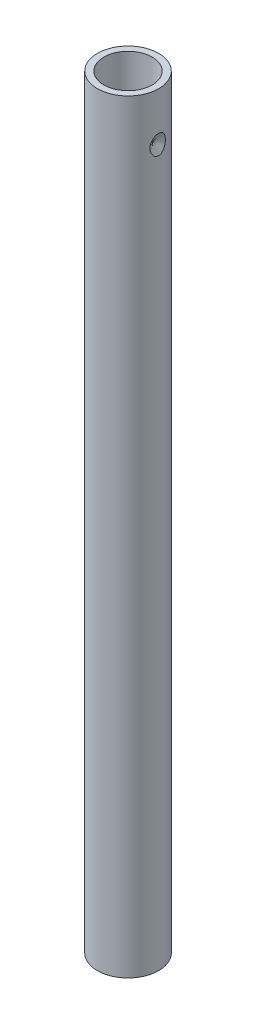
ISO-10303-21;
HEADER;
FILE_DESCRIPTION(('STEP AP214'),'2;1');
FILE_NAME('part.step','',(''),(''),'','','');
FILE_SCHEMA(('AUTOMOTIVE_DESIGN { 1 0 10303 214 1 1 1 1 }'));
ENDSEC;
DATA;
#1=APPLICATION_CONTEXT('core data for automotive mechanical design processes');
#2=APPLICATION_PROTOCOL_DEFINITION('international standard','automotive_design',2000,#1);
#3=PRODUCT_CONTEXT('',#1,'mechanical');
#4=PRODUCT('Part','Part','',(#3));
#5=PRODUCT_RELATED_PRODUCT_CATEGORY('part','',(#4));
#6=PRODUCT_DEFINITION_FORMATION('','',#4);
#7=PRODUCT_DEFINITION_CONTEXT('part definition',#1,'design');
#8=PRODUCT_DEFINITION('design','',#6,#7);
#9=PRODUCT_DEFINITION_SHAPE('','',#8);
#10=(LENGTH_UNIT() NAMED_UNIT(*) SI_UNIT(.MILLI.,.METRE.));
#11=(NAMED_UNIT(*) PLANE_ANGLE_UNIT() SI_UNIT($,.RADIAN.));
#12=(NAMED_UNIT(*) SI_UNIT($,.STERADIAN.) SOLID_ANGLE_UNIT());
#13=UNCERTAINTY_MEASURE_WITH_UNIT(LENGTH_MEASURE(1.E-05),#10,'distance_accuracy_value','');
#14=(GEOMETRIC_REPRESENTATION_CONTEXT(3) GLOBAL_UNCERTAINTY_ASSIGNED_CONTEXT((#13)) GLOBAL_UNIT_ASSIGNED_CONTEXT((#10,
#11,#12)) REPRESENTATION_CONTEXT('',''));
#15=CARTESIAN_POINT('',(0.,0.,0.));
#16=DIRECTION('',(0.,0.,1.));
#17=DIRECTION('',(1.,0.,0.));
#18=AXIS2_PLACEMENT_3D('',#15,#16,#17);
#19=CARTESIAN_POINT('',(0.,237.,0.));
#20=DIRECTION('',(0.,-1.,0.));
#21=DIRECTION('',(0.,0.,-1.));
#22=AXIS2_PLACEMENT_3D('',#19,#20,#21);
#23=CYLINDRICAL_SURFACE('',#22,9.5);
#24=CARTESIAN_POINT('',(9.30331945435661,220.240363881302,-1.92308271537907));
#25=CARTESIAN_POINT('',(9.3205682513565,220.098077717842,-1.83964786494816));
#26=CARTESIAN_POINT('',(9.33898201531258,219.96226362657,-1.74498906637923));
#27=CARTESIAN_POINT('',(9.37605122081402,219.708984713685,-1.53335364857119));
#28=CARTESIAN_POINT('',(9.39470673149405,219.591525272399,-1.41637050759949));
#29=CARTESIAN_POINT('',(9.4248222547172,219.411040334109,-1.19640808146251));
#30=CARTESIAN_POINT('',(9.43684581135679,219.341943065757,-1.09849638038467));
#31=CARTESIAN_POINT('',(9.45853707007024,219.220367872439,-0.892610310459543));
#32=CARTESIAN_POINT('',(9.46820755645551,219.167870283355,-0.784648045421287));
#33=CARTESIAN_POINT('',(9.4841662643761,219.082475932955,-0.559794937083566));
#34=CARTESIAN_POINT('',(9.49042453211237,219.049752494483,-0.442834992035052));
#35=CARTESIAN_POINT('',(9.49854000686532,219.007486340731,-0.204641536907017));
#36=CARTESIAN_POINT('',(9.50040072762256,218.997925118159,-0.0834115173820113));
#37=CARTESIAN_POINT('',(9.49951393284147,219.002515250352,0.142445543535518));
#38=CARTESIAN_POINT('',(9.49734350559846,219.013696848995,0.247147282236112));
#39=CARTESIAN_POINT('',(9.48974877754229,219.053297622748,0.453085988887264));
#40=CARTESIAN_POINT('',(9.4843242996034,219.081717736191,0.554322767914701));
#41=CARTESIAN_POINT('',(9.47082129289798,219.153814686052,0.750459033835123));
#42=CARTESIAN_POINT('',(9.46275394930173,219.197427273124,0.845383234557017));
#43=CARTESIAN_POINT('',(9.44467917912963,219.297693337623,1.02784192929846));
#44=CARTESIAN_POINT('',(9.43467057170101,219.354354756482,1.11537187870465));
#45=CARTESIAN_POINT('',(9.4088817797635,219.505293080797,1.31811362262447));
#46=CARTESIAN_POINT('',(9.3924718949125,219.605262119741,1.42901940038598));
#47=CARTESIAN_POINT('',(9.35917459797884,219.821940057669,1.63296589386592));
#48=CARTESIAN_POINT('',(9.34228645910024,219.938675668537,1.72597753733587));
#49=CARTESIAN_POINT('',(9.30946353029029,220.18641888736,1.89510294248025));
#50=CARTESIAN_POINT('',(9.2935464801619,220.317611637433,1.97094717475366));
#51=CARTESIAN_POINT('',(9.26435311198718,220.58932539887,2.10389795054743));
#52=CARTESIAN_POINT('',(9.25107628897011,220.729844619579,2.16100807851897));
#53=CARTESIAN_POINT('',(9.22594654020162,221.046704228526,2.26615158730077));
#54=CARTESIAN_POINT('',(9.21493180000209,221.224519387117,2.30997942188249));
#55=CARTESIAN_POINT('',(9.19964044160906,221.585057470279,2.37014121795866));
#56=CARTESIAN_POINT('',(9.19536729161454,221.767782871789,2.38646102829441));
#57=CARTESIAN_POINT('',(9.19403651493305,222.146589911392,2.39159631780864));
#58=CARTESIAN_POINT('',(9.19750907168689,222.342704575607,2.37839067338919));
#59=CARTESIAN_POINT('',(9.21231794944298,222.73004707859,2.32036118576884));
#60=CARTESIAN_POINT('',(9.22365990447404,222.921271314331,2.27551468918041));
#61=CARTESIAN_POINT('',(9.25272798812209,223.293880719408,2.1542810750237));
#62=CARTESIAN_POINT('',(9.27048098887978,223.475220720325,2.07776099604352));
#63=CARTESIAN_POINT('',(9.30989025188913,223.820755391043,1.89336033066649));
#64=CARTESIAN_POINT('',(9.33154115387053,223.984973123144,1.78552268786872));
#65=CARTESIAN_POINT('',(9.36886589196603,224.243001315043,1.5754584364712));
#66=CARTESIAN_POINT('',(9.3844059064965,224.343240383083,1.48107085666357));
#67=CARTESIAN_POINT('',(9.4143001154384,224.527321161368,1.27730765425575));
#68=CARTESIAN_POINT('',(9.42865618331585,224.611189076309,1.1679564686942));
#69=CARTESIAN_POINT('',(9.4521860182381,224.744494981209,0.956721109213079));
#70=CARTESIAN_POINT('',(9.46182743569667,224.797420988382,0.857098529071551));
#71=CARTESIAN_POINT('',(9.47828310041145,224.8863090338,0.650287593626391));
#72=CARTESIAN_POINT('',(9.4850991519269,224.92228190022,0.54310411799767));
#73=CARTESIAN_POINT('',(9.4951415688533,224.974910400789,0.323188169589253));
#74=CARTESIAN_POINT('',(9.49834658452832,224.991451169721,0.210426766657321));
#75=CARTESIAN_POINT('',(9.50066117146834,225.003420454326,-0.016250813565819));
#76=CARTESIAN_POINT('',(9.49977201052416,224.998855505532,-0.13016662248605));
#77=CARTESIAN_POINT('',(9.49430920263609,224.970500920199,-0.344164209716398));
#78=CARTESIAN_POINT('',(9.49010090673551,224.94861689112,-0.444516932983925));
#79=CARTESIAN_POINT('',(9.47890086546302,224.889440519051,-0.640366365072159));
#80=CARTESIAN_POINT('',(9.47190869686382,224.852145833172,-0.735862333038245));
#81=CARTESIAN_POINT('',(9.45532925880469,224.761696764469,-0.925369644769139));
#82=CARTESIAN_POINT('',(9.44561870751433,224.707771945057,-1.0189991559258));
#83=CARTESIAN_POINT('',(9.42463196922951,224.587482194031,-1.19767389648297));
#84=CARTESIAN_POINT('',(9.41335461016729,224.521107936344,-1.28271261642474));
#85=CARTESIAN_POINT('',(9.38453379375241,224.344514569274,-1.4814993918219));
#86=CARTESIAN_POINT('',(9.36653857813747,224.228359611221,-1.58993051073861));
#87=CARTESIAN_POINT('',(9.33106857755977,223.979828941767,-1.78638208698276));
#88=CARTESIAN_POINT('',(9.3135946841753,223.847427223253,-1.87436914948766));
#89=CARTESIAN_POINT('',(9.28074323950532,223.568968903135,-2.03083229215919));
#90=CARTESIAN_POINT('',(9.26539749799533,223.422750820193,-2.09902617354033));
#91=CARTESIAN_POINT('',(9.23856023120007,223.121982730775,-2.21415691883779));
#92=CARTESIAN_POINT('',(9.22706707168205,222.967436289492,-2.26110279894414));
#93=CARTESIAN_POINT('',(9.20747604162264,222.626626669422,-2.3397313179041));
#94=CARTESIAN_POINT('',(9.20027467926272,222.439401785387,-2.36751738976653));
#95=CARTESIAN_POINT('',(9.19350706778845,222.062565600694,-2.39365820306267));
#96=CARTESIAN_POINT('',(9.19395050298348,221.872951577232,-2.39197561401703));
#97=CARTESIAN_POINT('',(9.20262324866387,221.488097134259,-2.35840079815986));
#98=CARTESIAN_POINT('',(9.21119763968509,221.292981079443,-2.32516956433907));
#99=CARTESIAN_POINT('',(9.23544653246736,220.911760606538,-2.22689797086692));
#100=CARTESIAN_POINT('',(9.25110105847308,220.725632454315,-2.16194706362328));
#101=CARTESIAN_POINT('',(9.27449679740996,220.494573084085,-2.05773576558742));
#102=CARTESIAN_POINT('',(9.28002175486094,220.442732160576,-2.03271302083013));
#103=CARTESIAN_POINT('',(9.29142352676927,220.34045214909,-1.97994447232083));
#104=CARTESIAN_POINT('',(9.29730056568281,220.290013986042,-1.95219692411273));
#105=CARTESIAN_POINT('',(9.30331945435661,220.240363881302,-1.92308271537907));
#106=B_SPLINE_CURVE_WITH_KNOTS('',3,(#24,#25,#26,#27,#28,#29,#30,#31,#32,#33,#34,#35,#36,#37,
#38,#39,#40,#41,#42,#43,#44,#45,#46,#47,#48,#49,#50,#51,#52,#53,#54,#55,#56,#57,#58,#59,#60,#61,
#62,#63,#64,#65,#66,#67,#68,#69,#70,#71,#72,#73,#74,#75,#76,#77,#78,#79,#80,#81,#82,#83,#84,#85,
#86,#87,#88,#89,#90,#91,#92,#93,#94,#95,#96,#97,#98,#99,#100,#101,#102,#103,#104,#105),
.UNSPECIFIED.,.T.,.F.,(4,2,2,2,2,2,2,2,2,2,2,2,2,2,2,2,2,2,2,2,2,2,2,2,2,2,2,2,2,2,2,2,2,2,2,2,
2,2,2,2,4),(0.,0.49732599868141,0.994797506962388,1.35475715395636,1.71428877825985,
2.07692768089329,2.43927672864534,2.75368810941831,3.06811660590518,3.38123120371586,
3.69453686696855,4.14272786991537,4.59164100196807,5.04717674086143,5.50262526985824,
6.05066410321502,6.59898478233917,7.18597963259616,7.77339517105879,8.36330201895839,
8.95240375739144,9.36661027821124,9.78014825729345,10.1184422617407,10.4565198999079,
10.7965860537203,11.1365469107186,11.4435677224101,11.7506352277714,12.074878796439,
12.3993662383006,12.8765227209621,13.3544532309496,13.8388961479173,14.3231333074707,
14.8888368171193,15.4552570036818,16.0468453924263,16.6367749980014,16.8102028624893,
16.9837424908282),.UNSPECIFIED.);
#107=CARTESIAN_POINT('',(9.30331945435661,220.240363881302,-1.92308271537907));
#108=VERTEX_POINT('',#107);
#109=EDGE_CURVE('E12',#108,#108,#106,.T.);
#110=ORIENTED_EDGE('',*,*,#109,.T.);
#111=EDGE_LOOP('',(#110));
#112=FACE_BOUND('',#111,.T.);
#113=CARTESIAN_POINT('',(0.,237.,0.));
#114=DIRECTION('',(0.,1.,0.));
#115=DIRECTION('',(1.,0.,0.));
#116=AXIS2_PLACEMENT_3D('',#113,#114,#115);
#117=CIRCLE('',#116,9.5);
#118=CARTESIAN_POINT('',(9.5,237.,0.));
#119=VERTEX_POINT('',#118);
#120=EDGE_CURVE('E77',#119,#119,#117,.T.);
#121=ORIENTED_EDGE('',*,*,#120,.F.);
#122=EDGE_LOOP('',(#121));
#123=FACE_BOUND('',#122,.T.);
#124=CARTESIAN_POINT('',(0.,0.,0.));
#125=DIRECTION('',(0.,1.,0.));
#126=DIRECTION('',(1.,0.,0.));
#127=AXIS2_PLACEMENT_3D('',#124,#125,#126);
#128=CIRCLE('',#127,9.5);
#129=CARTESIAN_POINT('',(9.5,0.,0.));
#130=VERTEX_POINT('',#129);
#131=EDGE_CURVE('E81',#130,#130,#128,.T.);
#132=ORIENTED_EDGE('',*,*,#131,.T.);
#133=EDGE_LOOP('',(#132));
#134=FACE_BOUND('',#133,.T.);
#135=CARTESIAN_POINT('',(-1.37749113235361,6.84256604088765,-9.3996020299037));
#136=CARTESIAN_POINT('',(-1.43985569767684,6.94520668087784,-9.39046382916753));
#137=CARTESIAN_POINT('',(-1.4932894219653,7.05337982069839,-9.38200901869604));
#138=CARTESIAN_POINT('',(-1.58177515873886,7.27717003093513,-9.36749705033879));
#139=CARTESIAN_POINT('',(-1.61681098481829,7.39279355611727,-9.36144200490249));
#140=CARTESIAN_POINT('',(-1.66844100973732,7.62952605038833,-9.352379612551));
#141=CARTESIAN_POINT('',(-1.68482952199372,7.75068115226809,-9.34940628942647));
#142=CARTESIAN_POINT('',(-1.69830319571157,7.99406121660748,-9.34696803872217));
#143=CARTESIAN_POINT('',(-1.69539152863666,8.11628599999749,-9.34750253472684));
#144=CARTESIAN_POINT('',(-1.66972870552011,8.3642280409708,-9.35212224043738));
#145=CARTESIAN_POINT('',(-1.64607985537263,8.48985077030532,-9.35636808450113));
#146=CARTESIAN_POINT('',(-1.57793207523912,8.73527096172136,-9.36810112195401));
#147=CARTESIAN_POINT('',(-1.53341996080827,8.85506468727446,-9.37559036476636));
#148=CARTESIAN_POINT('',(-1.42489245519886,9.0828901010676,-9.39269108552869));
#149=CARTESIAN_POINT('',(-1.36121493282038,9.19108471363829,-9.40226506172194));
#150=CARTESIAN_POINT('',(-1.21477840409148,9.39356467729315,-9.42230023018946));
#151=CARTESIAN_POINT('',(-1.13205163086649,9.48787308811734,-9.43275990508546));
#152=CARTESIAN_POINT('',(-0.973453104443292,9.63472101547047,-9.45023420646979));
#153=CARTESIAN_POINT('',(-0.901678349842504,9.69168277097968,-9.45742128956647));
#154=CARTESIAN_POINT('',(-0.749636803958259,9.79307168305966,-9.47068369452202));
#155=CARTESIAN_POINT('',(-0.669376134238821,9.83750779167801,-9.47675980929027));
#156=CARTESIAN_POINT('',(-0.501485896658554,9.91169491246701,-9.48712909097785));
#157=CARTESIAN_POINT('',(-0.413809400864985,9.94134271699067,-9.4914096949641));
#158=CARTESIAN_POINT('',(-0.234325356129351,9.98338450743539,-9.49753238715357));
#159=CARTESIAN_POINT('',(-0.142520922030839,9.99579128474075,-9.49937628313823));
#160=CARTESIAN_POINT('',(0.0308205645608719,10.0020122903735,-9.50029834712539));
#161=CARTESIAN_POINT('',(0.112289057590166,9.99785019276744,-9.49967756935338));
#162=CARTESIAN_POINT('',(0.273257048583079,9.97566478404702,-9.49641029634412));
#163=CARTESIAN_POINT('',(0.352756718672331,9.95764268909916,-9.49376397884102));
#164=CARTESIAN_POINT('',(0.50571757329182,9.90940626459443,-9.4868320268608));
#165=CARTESIAN_POINT('',(0.5792784005435,9.87949795688755,-9.48258766982859));
#166=CARTESIAN_POINT('',(0.720947434234786,9.80895523805489,-9.47287098418225));
#167=CARTESIAN_POINT('',(0.789054127139657,9.76831786293886,-9.46739831630021));
#168=CARTESIAN_POINT('',(0.925468342748628,9.6732340685747,-9.45508721433196));
#169=CARTESIAN_POINT('',(0.993075269572028,9.6177969367039,-9.44816618768056));
#170=CARTESIAN_POINT('',(1.11959033981293,9.49781204604392,-9.43401175956139));
#171=CARTESIAN_POINT('',(1.17849373427887,9.4332593507747,-9.42677819032089));
#172=CARTESIAN_POINT('',(1.29591947635516,9.28578904074301,-9.41141068046759));
#173=CARTESIAN_POINT('',(1.35283852262069,9.20158987083923,-9.40332039961641));
#174=CARTESIAN_POINT('',(1.4538670335368,9.02574700840497,-9.38823099783758));
#175=CARTESIAN_POINT('',(1.49796918225618,8.93409910214937,-9.38123250115575));
#176=CARTESIAN_POINT('',(1.57854440019685,8.73174804454626,-9.3680367835614));
#177=CARTESIAN_POINT('',(1.61297690650578,8.62021140429142,-9.36210387529663));
#178=CARTESIAN_POINT('',(1.66437075738392,8.39307017601492,-9.35310363859543));
#179=CARTESIAN_POINT('',(1.68132547771236,8.27746406278032,-9.35003739669271));
#180=CARTESIAN_POINT('',(1.69823462950287,8.03585498279648,-9.34698311565807));
#181=CARTESIAN_POINT('',(1.69675600187014,7.90974592337056,-9.34725453451841));
#182=CARTESIAN_POINT('',(1.6732973675949,7.65948644104403,-9.35148179467974));
#183=CARTESIAN_POINT('',(1.65131272758549,7.53533646724929,-9.35543846866984));
#184=CARTESIAN_POINT('',(1.58663073584787,7.29088411062147,-9.36662665048601));
#185=CARTESIAN_POINT('',(1.54365952059442,7.17065567086621,-9.37390137168461));
#186=CARTESIAN_POINT('',(1.43724818302922,6.93965186999337,-9.39080457590931));
#187=CARTESIAN_POINT('',(1.37379963833491,6.82888042231,-9.40043402704679));
#188=CARTESIAN_POINT('',(1.23075844034427,6.62648650577517,-9.42020068842502));
#189=CARTESIAN_POINT('',(1.15212371007061,6.53418636998365,-9.43028895328503));
#190=CARTESIAN_POINT('',(0.978121952912079,6.36699088866695,-9.44991374051049));
#191=CARTESIAN_POINT('',(0.882796313278833,6.29205353356009,-9.45945155177529));
#192=CARTESIAN_POINT('',(0.70880695196834,6.18405433303919,-9.4737930822712));
#193=CARTESIAN_POINT('',(0.633773644403819,6.14517808139237,-9.47915740360232));
#194=CARTESIAN_POINT('',(0.478216875412631,6.08035083052091,-9.48827460813303));
#195=CARTESIAN_POINT('',(0.397698060893251,6.0543890421966,-9.49202883608645));
#196=CARTESIAN_POINT('',(0.232914232196794,6.01683510852209,-9.49750323265073));
#197=CARTESIAN_POINT('',(0.148634738743084,6.0053045617051,-9.49921468039874));
#198=CARTESIAN_POINT('',(-0.0206431896638417,5.99760634553994,-9.5003542138111));
#199=CARTESIAN_POINT('',(-0.105641524089031,6.00143656235505,-9.49978261365197));
#200=CARTESIAN_POINT('',(-0.267614946469455,6.02337611439722,-9.49655155532033));
#201=CARTESIAN_POINT('',(-0.344734702065267,6.04046536017784,-9.49404130896424));
#202=CARTESIAN_POINT('',(-0.495170973360162,6.08671072641683,-9.48738536183951));
#203=CARTESIAN_POINT('',(-0.568486870832571,6.11586880150578,-9.48323939615987));
#204=CARTESIAN_POINT('',(-0.712866256136216,6.18635690729789,-9.47350463676184));
#205=CARTESIAN_POINT('',(-0.783692556606428,6.22816177423496,-9.46786086564591));
#206=CARTESIAN_POINT('',(-0.91839414750498,6.32162721810866,-9.4557461070722));
#207=CARTESIAN_POINT('',(-0.982267416051691,6.37329064987132,-9.44927488018075));
#208=CARTESIAN_POINT('',(-1.10751843606593,6.48957852245281,-9.43544970847718));
#209=CARTESIAN_POINT('',(-1.16821154670701,6.55493478562768,-9.42806767061829));
#210=CARTESIAN_POINT('',(-1.2800752222758,6.69336488954483,-9.41353236498305));
#211=CARTESIAN_POINT('',(-1.33123927133661,6.76644395792408,-9.4063792564939));
#212=CARTESIAN_POINT('',(-1.37749113235361,6.84256604088765,-9.3996020299037));
#213=B_SPLINE_CURVE_WITH_KNOTS('',3,(#135,#136,#137,#138,#139,#140,#141,#142,#143,#144,#145,
#146,#147,#148,#149,#150,#151,#152,#153,#154,#155,#156,#157,#158,#159,#160,#161,#162,#163,#164,
#165,#166,#167,#168,#169,#170,#171,#172,#173,#174,#175,#176,#177,#178,#179,#180,#181,#182,#183,
#184,#185,#186,#187,#188,#189,#190,#191,#192,#193,#194,#195,#196,#197,#198,#199,#200,#201,#202,
#203,#204,#205,#206,#207,#208,#209,#210,#211,#212),.UNSPECIFIED.,.T.,.F.,(4,2,2,2,2,2,2,2,2,2,2,
2,2,2,2,2,2,2,2,2,2,2,2,2,2,2,2,2,2,2,2,2,2,2,2,2,2,2,4),(0.,0.361017444430087,
0.722351980815375,1.08763466293914,1.4528573221997,1.83471674152935,2.2168178012086,
2.59254232257339,2.96763569472135,3.24228036174028,3.51672824034096,3.79306559109294,
4.06919781324193,4.31270226535074,4.55618535322914,4.79376841053845,5.03141717085944,
5.29352204719309,5.55576941314882,5.86044303228279,6.16529022016759,6.5144461531425,
6.86373437080963,7.24033611522238,7.61702297403163,7.99876231773089,8.38065887240928,
8.74359495063935,9.10564350796716,9.35863500647286,9.61141479242821,9.86526990799474,
10.1190900910628,10.3551123138431,10.5911727770249,10.8375148704518,11.0839284077443,
11.3514899659387,11.6192338133936),.UNSPECIFIED.);
#214=CARTESIAN_POINT('',(-1.37749113235361,6.84256604088765,-9.3996020299037));
#215=VERTEX_POINT('',#214);
#216=EDGE_CURVE('E59',#215,#215,#213,.T.);
#217=ORIENTED_EDGE('',*,*,#216,.F.);
#218=EDGE_LOOP('',(#217));
#219=FACE_BOUND('',#218,.T.);
#220=ADVANCED_FACE('F47',(#112,#123,#134,#219),#23,.T.);
#221=CARTESIAN_POINT('',(0.,237.,0.));
#222=DIRECTION('',(0.,1.,0.));
#223=DIRECTION('',(0.,0.,1.));
#224=AXIS2_PLACEMENT_3D('',#221,#222,#223);
#225=PLANE('',#224);
#226=ORIENTED_EDGE('',*,*,#120,.T.);
#227=EDGE_LOOP('',(#226));
#228=FACE_BOUND('',#227,.T.);
#229=CARTESIAN_POINT('',(0.,237.,0.));
#230=DIRECTION('',(0.,1.,0.));
#231=DIRECTION('',(0.,0.,1.));
#232=AXIS2_PLACEMENT_3D('',#229,#230,#231);
#233=CIRCLE('',#232,7.5);
#234=CARTESIAN_POINT('',(0.,237.,7.5));
#235=VERTEX_POINT('',#234);
#236=EDGE_CURVE('E111',#235,#235,#233,.T.);
#237=ORIENTED_EDGE('',*,*,#236,.F.);
#238=EDGE_LOOP('',(#237));
#239=FACE_BOUND('',#238,.T.);
#240=ADVANCED_FACE('F73',(#228,#239),#225,.T.);
#241=CARTESIAN_POINT('',(0.,0.,0.));
#242=DIRECTION('',(0.,1.,0.));
#243=DIRECTION('',(0.,0.,1.));
#244=AXIS2_PLACEMENT_3D('',#241,#242,#243);
#245=PLANE('',#244);
#246=ORIENTED_EDGE('',*,*,#131,.F.);
#247=EDGE_LOOP('',(#246));
#248=FACE_BOUND('',#247,.T.);
#249=CARTESIAN_POINT('',(0.,0.,0.));
#250=DIRECTION('',(0.,1.,0.));
#251=DIRECTION('',(0.,0.,1.));
#252=AXIS2_PLACEMENT_3D('',#249,#250,#251);
#253=CIRCLE('',#252,7.5);
#254=CARTESIAN_POINT('',(0.,0.,7.5));
#255=VERTEX_POINT('',#254);
#256=EDGE_CURVE('E109',#255,#255,#253,.T.);
#257=ORIENTED_EDGE('',*,*,#256,.T.);
#258=EDGE_LOOP('',(#257));
#259=FACE_BOUND('',#258,.T.);
#260=ADVANCED_FACE('F98',(#248,#259),#245,.F.);
#261=CARTESIAN_POINT('',(0.,237.,0.));
#262=DIRECTION('',(0.,-1.,0.));
#263=DIRECTION('',(0.,0.,-1.));
#264=AXIS2_PLACEMENT_3D('',#261,#262,#263);
#265=CYLINDRICAL_SURFACE('',#264,7.5);
#266=ORIENTED_EDGE('',*,*,#236,.T.);
#267=EDGE_LOOP('',(#266));
#268=FACE_BOUND('',#267,.T.);
#269=ORIENTED_EDGE('',*,*,#256,.F.);
#270=EDGE_LOOP('',(#269));
#271=FACE_BOUND('',#270,.T.);
#272=ADVANCED_FACE('F94',(#268,#271),#265,.F.);
#273=CARTESIAN_POINT('',(0.,8.,-9.5));
#274=DIRECTION('',(0.,0.,-1.));
#275=DIRECTION('',(-1.,0.,0.));
#276=AXIS2_PLACEMENT_3D('',#273,#274,#275);
#277=CONICAL_SURFACE('',#276,2.,1.10714871779409);
#278=CARTESIAN_POINT('',(0.,8.,-8.5));
#279=VERTEX_POINT('',#278);
#280=VERTEX_LOOP('',#279);
#281=FACE_BOUND('',#280,.T.);
#282=ORIENTED_EDGE('',*,*,#216,.T.);
#283=EDGE_LOOP('',(#282));
#284=FACE_BOUND('',#283,.T.);
#285=ADVANCED_FACE('F68',(#281,#284),#277,.F.);
#286=CARTESIAN_POINT('',(9.5,222.,0.));
#287=DIRECTION('',(1.,0.,0.));
#288=DIRECTION('',(0.,0.,-1.));
#289=AXIS2_PLACEMENT_3D('',#286,#287,#288);
#290=CONICAL_SURFACE('',#289,3.,1.10714871779409);
#291=CARTESIAN_POINT('',(8.,222.,0.));
#292=VERTEX_POINT('',#291);
#293=VERTEX_LOOP('',#292);
#294=FACE_BOUND('',#293,.T.);
#295=ORIENTED_EDGE('',*,*,#109,.F.);
#296=EDGE_LOOP('',(#295));
#297=FACE_BOUND('',#296,.T.);
#298=ADVANCED_FACE('F65',(#294,#297),#290,.F.);
#299=CLOSED_SHELL('',(#220,#240,#260,#272,#285,#298));
#300=MANIFOLD_SOLID_BREP('B2',#299);
#301=ADVANCED_BREP_SHAPE_REPRESENTATION('',(#18,#300),#14);
#302=SHAPE_DEFINITION_REPRESENTATION(#9,#301);
ENDSEC;
END-ISO-10303-21;
